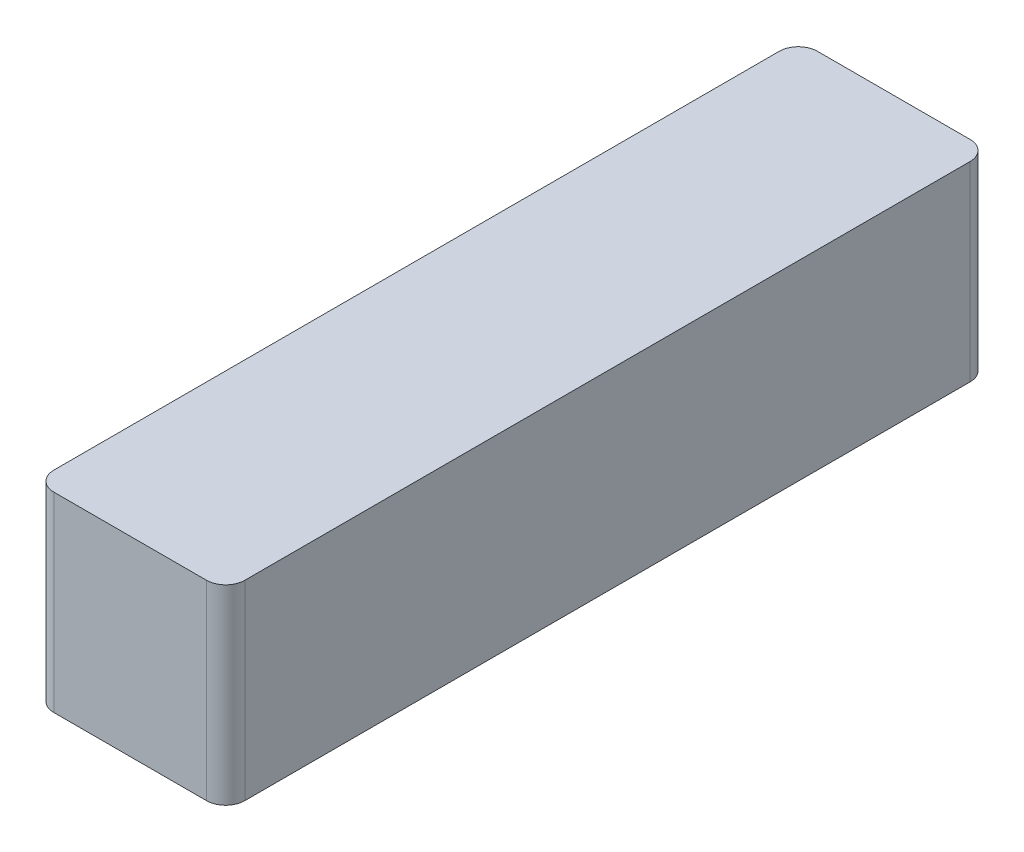
ISO-10303-21;
HEADER;
FILE_DESCRIPTION(('STEP AP214'),'2;1');
FILE_NAME('part.step','',(''),(''),'','','');
FILE_SCHEMA(('AUTOMOTIVE_DESIGN { 1 0 10303 214 1 1 1 1 }'));
ENDSEC;
DATA;
#1=APPLICATION_CONTEXT('core data for automotive mechanical design processes');
#2=APPLICATION_PROTOCOL_DEFINITION('international standard','automotive_design',2000,#1);
#3=PRODUCT_CONTEXT('',#1,'mechanical');
#4=PRODUCT('Part','Part','',(#3));
#5=PRODUCT_RELATED_PRODUCT_CATEGORY('part','',(#4));
#6=PRODUCT_DEFINITION_FORMATION('','',#4);
#7=PRODUCT_DEFINITION_CONTEXT('part definition',#1,'design');
#8=PRODUCT_DEFINITION('design','',#6,#7);
#9=PRODUCT_DEFINITION_SHAPE('','',#8);
#10=(LENGTH_UNIT() NAMED_UNIT(*) SI_UNIT(.MILLI.,.METRE.));
#11=(NAMED_UNIT(*) PLANE_ANGLE_UNIT() SI_UNIT($,.RADIAN.));
#12=(NAMED_UNIT(*) SI_UNIT($,.STERADIAN.) SOLID_ANGLE_UNIT());
#13=UNCERTAINTY_MEASURE_WITH_UNIT(LENGTH_MEASURE(1.E-05),#10,'distance_accuracy_value','');
#14=(GEOMETRIC_REPRESENTATION_CONTEXT(3) GLOBAL_UNCERTAINTY_ASSIGNED_CONTEXT((#13)) GLOBAL_UNIT_ASSIGNED_CONTEXT((#10,
#11,#12)) REPRESENTATION_CONTEXT('',''));
#15=CARTESIAN_POINT('',(0.,0.,0.));
#16=DIRECTION('',(0.,0.,1.));
#17=DIRECTION('',(1.,0.,0.));
#18=AXIS2_PLACEMENT_3D('',#15,#16,#17);
#19=CARTESIAN_POINT('',(0.,10.,0.));
#20=DIRECTION('',(1.,0.,0.));
#21=DIRECTION('',(0.,0.,-1.));
#22=AXIS2_PLACEMENT_3D('',#19,#20,#21);
#23=PLANE('',#22);
#24=DIRECTION('',(0.,0.,1.));
#25=VECTOR('',#24,1.);
#26=CARTESIAN_POINT('',(0.,10.,0.));
#27=LINE('',#26,#25);
#28=CARTESIAN_POINT('',(0.,10.,-39.));
#29=VERTEX_POINT('',#28);
#30=CARTESIAN_POINT('',(0.,10.,-1.));
#31=VERTEX_POINT('',#30);
#32=EDGE_CURVE('E129',#29,#31,#27,.T.);
#33=ORIENTED_EDGE('',*,*,#32,.F.);
#34=DIRECTION('',(0.,-1.,0.));
#35=VECTOR('',#34,1.);
#36=CARTESIAN_POINT('',(0.,10.,-39.));
#37=LINE('',#36,#35);
#38=CARTESIAN_POINT('',(0.,0.,-39.));
#39=VERTEX_POINT('',#38);
#40=EDGE_CURVE('E155',#29,#39,#37,.T.);
#41=ORIENTED_EDGE('',*,*,#40,.T.);
#42=DIRECTION('',(0.,0.,1.));
#43=VECTOR('',#42,1.);
#44=CARTESIAN_POINT('',(0.,0.,0.));
#45=LINE('',#44,#43);
#46=CARTESIAN_POINT('',(0.,0.,-1.));
#47=VERTEX_POINT('',#46);
#48=EDGE_CURVE('E163',#39,#47,#45,.T.);
#49=ORIENTED_EDGE('',*,*,#48,.T.);
#50=DIRECTION('',(0.,-1.,0.));
#51=VECTOR('',#50,1.);
#52=CARTESIAN_POINT('',(0.,10.,-1.));
#53=LINE('',#52,#51);
#54=EDGE_CURVE('E153',#47,#31,#53,.F.);
#55=ORIENTED_EDGE('',*,*,#54,.T.);
#56=EDGE_LOOP('',(#33,#41,#49,#55));
#57=FACE_BOUND('',#56,.T.);
#58=ADVANCED_FACE('F38',(#57),#23,.F.);
#59=CARTESIAN_POINT('',(0.,10.,0.));
#60=DIRECTION('',(0.,0.,-1.));
#61=DIRECTION('',(-1.,0.,0.));
#62=AXIS2_PLACEMENT_3D('',#59,#60,#61);
#63=PLANE('',#62);
#64=DIRECTION('',(1.,0.,0.));
#65=VECTOR('',#64,1.);
#66=CARTESIAN_POINT('',(0.,0.,0.));
#67=LINE('',#66,#65);
#68=CARTESIAN_POINT('',(1.,0.,0.));
#69=VERTEX_POINT('',#68);
#70=CARTESIAN_POINT('',(9.,0.,0.));
#71=VERTEX_POINT('',#70);
#72=EDGE_CURVE('E134',#69,#71,#67,.T.);
#73=ORIENTED_EDGE('',*,*,#72,.T.);
#74=DIRECTION('',(0.,-1.,0.));
#75=VECTOR('',#74,1.);
#76=CARTESIAN_POINT('',(9.,10.,0.));
#77=LINE('',#76,#75);
#78=CARTESIAN_POINT('',(9.,10.,0.));
#79=VERTEX_POINT('',#78);
#80=EDGE_CURVE('E11',#71,#79,#77,.F.);
#81=ORIENTED_EDGE('',*,*,#80,.T.);
#82=DIRECTION('',(1.,0.,0.));
#83=VECTOR('',#82,1.);
#84=CARTESIAN_POINT('',(0.,10.,0.));
#85=LINE('',#84,#83);
#86=CARTESIAN_POINT('',(1.,10.,0.));
#87=VERTEX_POINT('',#86);
#88=EDGE_CURVE('E132',#87,#79,#85,.T.);
#89=ORIENTED_EDGE('',*,*,#88,.F.);
#90=DIRECTION('',(0.,-1.,0.));
#91=VECTOR('',#90,1.);
#92=CARTESIAN_POINT('',(1.,10.,0.));
#93=LINE('',#92,#91);
#94=EDGE_CURVE('E46',#87,#69,#93,.T.);
#95=ORIENTED_EDGE('',*,*,#94,.T.);
#96=EDGE_LOOP('',(#73,#81,#89,#95));
#97=FACE_BOUND('',#96,.T.);
#98=ADVANCED_FACE('F160',(#97),#63,.F.);
#99=CARTESIAN_POINT('',(10.,10.,0.));
#100=DIRECTION('',(-1.,0.,0.));
#101=DIRECTION('',(0.,0.,1.));
#102=AXIS2_PLACEMENT_3D('',#99,#100,#101);
#103=PLANE('',#102);
#104=DIRECTION('',(0.,0.,-1.));
#105=VECTOR('',#104,1.);
#106=CARTESIAN_POINT('',(10.,0.,0.));
#107=LINE('',#106,#105);
#108=CARTESIAN_POINT('',(10.,0.,-1.));
#109=VERTEX_POINT('',#108);
#110=CARTESIAN_POINT('',(10.,0.,-39.));
#111=VERTEX_POINT('',#110);
#112=EDGE_CURVE('E130',#109,#111,#107,.T.);
#113=ORIENTED_EDGE('',*,*,#112,.T.);
#114=DIRECTION('',(0.,-1.,0.));
#115=VECTOR('',#114,1.);
#116=CARTESIAN_POINT('',(10.,10.,-39.));
#117=LINE('',#116,#115);
#118=CARTESIAN_POINT('',(10.,10.,-39.));
#119=VERTEX_POINT('',#118);
#120=EDGE_CURVE('E108',#111,#119,#117,.F.);
#121=ORIENTED_EDGE('',*,*,#120,.T.);
#122=DIRECTION('',(0.,0.,-1.));
#123=VECTOR('',#122,1.);
#124=CARTESIAN_POINT('',(10.,10.,0.));
#125=LINE('',#124,#123);
#126=CARTESIAN_POINT('',(10.,10.,-1.));
#127=VERTEX_POINT('',#126);
#128=EDGE_CURVE('E167',#127,#119,#125,.T.);
#129=ORIENTED_EDGE('',*,*,#128,.F.);
#130=DIRECTION('',(0.,-1.,0.));
#131=VECTOR('',#130,1.);
#132=CARTESIAN_POINT('',(10.,10.,-1.));
#133=LINE('',#132,#131);
#134=EDGE_CURVE('E113',#127,#109,#133,.T.);
#135=ORIENTED_EDGE('',*,*,#134,.T.);
#136=EDGE_LOOP('',(#113,#121,#129,#135));
#137=FACE_BOUND('',#136,.T.);
#138=ADVANCED_FACE('F177',(#137),#103,.F.);
#139=CARTESIAN_POINT('',(0.,10.,-40.));
#140=DIRECTION('',(0.,0.,1.));
#141=DIRECTION('',(1.,0.,0.));
#142=AXIS2_PLACEMENT_3D('',#139,#140,#141);
#143=PLANE('',#142);
#144=DIRECTION('',(-1.,0.,0.));
#145=VECTOR('',#144,1.);
#146=CARTESIAN_POINT('',(0.,10.,-40.));
#147=LINE('',#146,#145);
#148=CARTESIAN_POINT('',(9.,10.,-40.));
#149=VERTEX_POINT('',#148);
#150=CARTESIAN_POINT('',(1.,10.,-40.));
#151=VERTEX_POINT('',#150);
#152=EDGE_CURVE('E123',#149,#151,#147,.T.);
#153=ORIENTED_EDGE('',*,*,#152,.F.);
#154=DIRECTION('',(0.,-1.,0.));
#155=VECTOR('',#154,1.);
#156=CARTESIAN_POINT('',(9.,10.,-40.));
#157=LINE('',#156,#155);
#158=CARTESIAN_POINT('',(9.,0.,-40.));
#159=VERTEX_POINT('',#158);
#160=EDGE_CURVE('E107',#149,#159,#157,.T.);
#161=ORIENTED_EDGE('',*,*,#160,.T.);
#162=DIRECTION('',(-1.,0.,0.));
#163=VECTOR('',#162,1.);
#164=CARTESIAN_POINT('',(0.,0.,-40.));
#165=LINE('',#164,#163);
#166=CARTESIAN_POINT('',(1.,0.,-40.));
#167=VERTEX_POINT('',#166);
#168=EDGE_CURVE('E120',#159,#167,#165,.T.);
#169=ORIENTED_EDGE('',*,*,#168,.T.);
#170=DIRECTION('',(0.,-1.,0.));
#171=VECTOR('',#170,1.);
#172=CARTESIAN_POINT('',(1.,10.,-40.));
#173=LINE('',#172,#171);
#174=EDGE_CURVE('E125',#167,#151,#173,.F.);
#175=ORIENTED_EDGE('',*,*,#174,.T.);
#176=EDGE_LOOP('',(#153,#161,#169,#175));
#177=FACE_BOUND('',#176,.T.);
#178=ADVANCED_FACE('F119',(#177),#143,.F.);
#179=CARTESIAN_POINT('',(0.,10.,0.));
#180=DIRECTION('',(0.,-1.,0.));
#181=DIRECTION('',(0.,0.,-1.));
#182=AXIS2_PLACEMENT_3D('',#179,#180,#181);
#183=PLANE('',#182);
#184=ORIENTED_EDGE('',*,*,#128,.T.);
#185=CARTESIAN_POINT('',(9.,10.,-39.));
#186=DIRECTION('',(0.,-1.,0.));
#187=DIRECTION('',(0.,0.,-1.));
#188=AXIS2_PLACEMENT_3D('',#185,#186,#187);
#189=CIRCLE('',#188,1.);
#190=EDGE_CURVE('E151',#119,#149,#189,.F.);
#191=ORIENTED_EDGE('',*,*,#190,.T.);
#192=ORIENTED_EDGE('',*,*,#152,.T.);
#193=CARTESIAN_POINT('',(1.,10.,-39.));
#194=DIRECTION('',(0.,-1.,0.));
#195=DIRECTION('',(0.,0.,-1.));
#196=AXIS2_PLACEMENT_3D('',#193,#194,#195);
#197=CIRCLE('',#196,1.);
#198=EDGE_CURVE('E149',#151,#29,#197,.F.);
#199=ORIENTED_EDGE('',*,*,#198,.T.);
#200=ORIENTED_EDGE('',*,*,#32,.T.);
#201=CARTESIAN_POINT('',(1.,10.,-1.));
#202=DIRECTION('',(0.,-1.,0.));
#203=DIRECTION('',(0.,0.,-1.));
#204=AXIS2_PLACEMENT_3D('',#201,#202,#203);
#205=CIRCLE('',#204,1.);
#206=EDGE_CURVE('E58',#31,#87,#205,.F.);
#207=ORIENTED_EDGE('',*,*,#206,.T.);
#208=ORIENTED_EDGE('',*,*,#88,.T.);
#209=CARTESIAN_POINT('',(9.,10.,-1.));
#210=DIRECTION('',(0.,-1.,0.));
#211=DIRECTION('',(0.,0.,-1.));
#212=AXIS2_PLACEMENT_3D('',#209,#210,#211);
#213=CIRCLE('',#212,1.);
#214=EDGE_CURVE('E147',#79,#127,#213,.F.);
#215=ORIENTED_EDGE('',*,*,#214,.T.);
#216=EDGE_LOOP('',(#184,#191,#192,#199,#200,#207,#208,#215));
#217=FACE_BOUND('',#216,.T.);
#218=ADVANCED_FACE('F171',(#217),#183,.F.);
#219=CARTESIAN_POINT('',(0.,0.,0.));
#220=DIRECTION('',(0.,-1.,0.));
#221=DIRECTION('',(0.,0.,-1.));
#222=AXIS2_PLACEMENT_3D('',#219,#220,#221);
#223=PLANE('',#222);
#224=ORIENTED_EDGE('',*,*,#168,.F.);
#225=CARTESIAN_POINT('',(9.,0.,-39.));
#226=DIRECTION('',(0.,-1.,0.));
#227=DIRECTION('',(0.,0.,-1.));
#228=AXIS2_PLACEMENT_3D('',#225,#226,#227);
#229=CIRCLE('',#228,1.);
#230=EDGE_CURVE('E103',#159,#111,#229,.T.);
#231=ORIENTED_EDGE('',*,*,#230,.T.);
#232=ORIENTED_EDGE('',*,*,#112,.F.);
#233=CARTESIAN_POINT('',(9.,0.,-1.));
#234=DIRECTION('',(0.,-1.,0.));
#235=DIRECTION('',(0.,0.,-1.));
#236=AXIS2_PLACEMENT_3D('',#233,#234,#235);
#237=CIRCLE('',#236,1.);
#238=EDGE_CURVE('E140',#109,#71,#237,.T.);
#239=ORIENTED_EDGE('',*,*,#238,.T.);
#240=ORIENTED_EDGE('',*,*,#72,.F.);
#241=CARTESIAN_POINT('',(1.,0.,-1.));
#242=DIRECTION('',(0.,-1.,0.));
#243=DIRECTION('',(0.,0.,-1.));
#244=AXIS2_PLACEMENT_3D('',#241,#242,#243);
#245=CIRCLE('',#244,1.);
#246=EDGE_CURVE('E124',#69,#47,#245,.T.);
#247=ORIENTED_EDGE('',*,*,#246,.T.);
#248=ORIENTED_EDGE('',*,*,#48,.F.);
#249=CARTESIAN_POINT('',(1.,0.,-39.));
#250=DIRECTION('',(0.,-1.,0.));
#251=DIRECTION('',(0.,0.,-1.));
#252=AXIS2_PLACEMENT_3D('',#249,#250,#251);
#253=CIRCLE('',#252,1.);
#254=EDGE_CURVE('E114',#39,#167,#253,.T.);
#255=ORIENTED_EDGE('',*,*,#254,.T.);
#256=EDGE_LOOP('',(#224,#231,#232,#239,#240,#247,#248,#255));
#257=FACE_BOUND('',#256,.T.);
#258=ADVANCED_FACE('F127',(#257),#223,.T.);
#259=CARTESIAN_POINT('',(9.,10.,-39.));
#260=DIRECTION('',(0.,-1.,0.));
#261=DIRECTION('',(0.,0.,-1.));
#262=AXIS2_PLACEMENT_3D('',#259,#260,#261);
#263=CYLINDRICAL_SURFACE('',#262,1.);
#264=ORIENTED_EDGE('',*,*,#190,.F.);
#265=ORIENTED_EDGE('',*,*,#120,.F.);
#266=ORIENTED_EDGE('',*,*,#230,.F.);
#267=ORIENTED_EDGE('',*,*,#160,.F.);
#268=EDGE_LOOP('',(#264,#265,#266,#267));
#269=FACE_BOUND('',#268,.T.);
#270=ADVANCED_FACE('F106',(#269),#263,.T.);
#271=CARTESIAN_POINT('',(1.,10.,-39.));
#272=DIRECTION('',(0.,-1.,0.));
#273=DIRECTION('',(0.,0.,-1.));
#274=AXIS2_PLACEMENT_3D('',#271,#272,#273);
#275=CYLINDRICAL_SURFACE('',#274,1.);
#276=ORIENTED_EDGE('',*,*,#198,.F.);
#277=ORIENTED_EDGE('',*,*,#174,.F.);
#278=ORIENTED_EDGE('',*,*,#254,.F.);
#279=ORIENTED_EDGE('',*,*,#40,.F.);
#280=EDGE_LOOP('',(#276,#277,#278,#279));
#281=FACE_BOUND('',#280,.T.);
#282=ADVANCED_FACE('F182',(#281),#275,.T.);
#283=CARTESIAN_POINT('',(9.,10.,-1.));
#284=DIRECTION('',(0.,-1.,0.));
#285=DIRECTION('',(0.,0.,-1.));
#286=AXIS2_PLACEMENT_3D('',#283,#284,#285);
#287=CYLINDRICAL_SURFACE('',#286,1.);
#288=ORIENTED_EDGE('',*,*,#214,.F.);
#289=ORIENTED_EDGE('',*,*,#80,.F.);
#290=ORIENTED_EDGE('',*,*,#238,.F.);
#291=ORIENTED_EDGE('',*,*,#134,.F.);
#292=EDGE_LOOP('',(#288,#289,#290,#291));
#293=FACE_BOUND('',#292,.T.);
#294=ADVANCED_FACE('F175',(#293),#287,.T.);
#295=CARTESIAN_POINT('',(1.,10.,-1.));
#296=DIRECTION('',(0.,-1.,0.));
#297=DIRECTION('',(0.,0.,-1.));
#298=AXIS2_PLACEMENT_3D('',#295,#296,#297);
#299=CYLINDRICAL_SURFACE('',#298,1.);
#300=ORIENTED_EDGE('',*,*,#206,.F.);
#301=ORIENTED_EDGE('',*,*,#54,.F.);
#302=ORIENTED_EDGE('',*,*,#246,.F.);
#303=ORIENTED_EDGE('',*,*,#94,.F.);
#304=EDGE_LOOP('',(#300,#301,#302,#303));
#305=FACE_BOUND('',#304,.T.);
#306=ADVANCED_FACE('F40',(#305),#299,.T.);
#307=CLOSED_SHELL('',(#58,#98,#138,#178,#218,#258,#270,#282,#294,#306));
#308=MANIFOLD_SOLID_BREP('B2',#307);
#309=ADVANCED_BREP_SHAPE_REPRESENTATION('',(#18,#308),#14);
#310=SHAPE_DEFINITION_REPRESENTATION(#9,#309);
ENDSEC;
END-ISO-10303-21;
